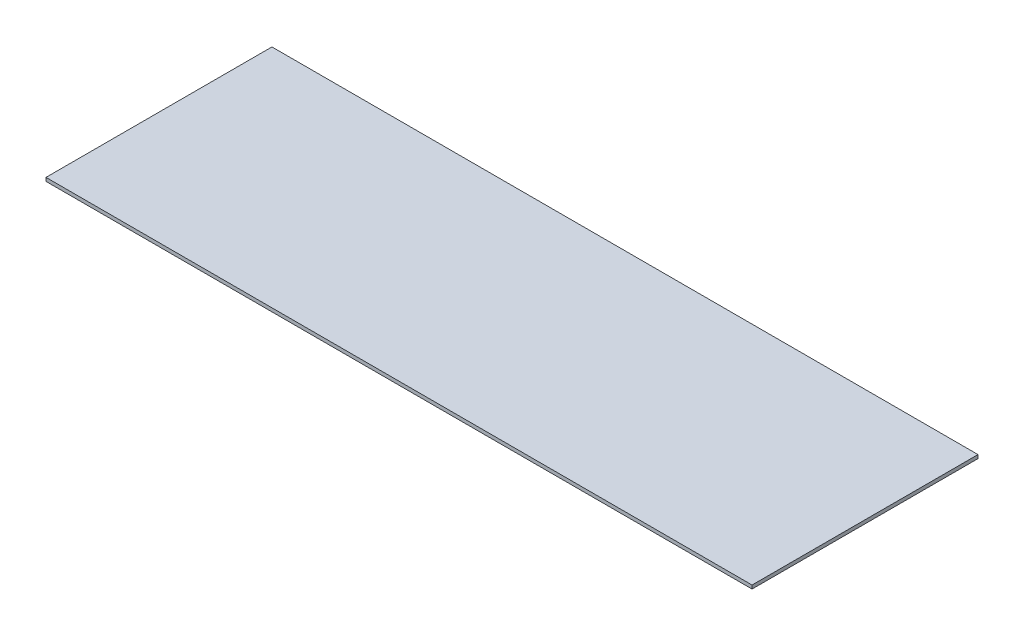
ISO-10303-21;
HEADER;
FILE_DESCRIPTION(('STEP AP214'),'2;1');
FILE_NAME('part.step','',(''),(''),'','','');
FILE_SCHEMA(('AUTOMOTIVE_DESIGN { 1 0 10303 214 1 1 1 1 }'));
ENDSEC;
DATA;
#1=APPLICATION_CONTEXT('core data for automotive mechanical design processes');
#2=APPLICATION_PROTOCOL_DEFINITION('international standard','automotive_design',2000,#1);
#3=PRODUCT_CONTEXT('',#1,'mechanical');
#4=PRODUCT('Part','Part','',(#3));
#5=PRODUCT_RELATED_PRODUCT_CATEGORY('part','',(#4));
#6=PRODUCT_DEFINITION_FORMATION('','',#4);
#7=PRODUCT_DEFINITION_CONTEXT('part definition',#1,'design');
#8=PRODUCT_DEFINITION('design','',#6,#7);
#9=PRODUCT_DEFINITION_SHAPE('','',#8);
#10=(LENGTH_UNIT() NAMED_UNIT(*) SI_UNIT(.MILLI.,.METRE.));
#11=(NAMED_UNIT(*) PLANE_ANGLE_UNIT() SI_UNIT($,.RADIAN.));
#12=(NAMED_UNIT(*) SI_UNIT($,.STERADIAN.) SOLID_ANGLE_UNIT());
#13=UNCERTAINTY_MEASURE_WITH_UNIT(LENGTH_MEASURE(1.E-05),#10,'distance_accuracy_value','');
#14=(GEOMETRIC_REPRESENTATION_CONTEXT(3) GLOBAL_UNCERTAINTY_ASSIGNED_CONTEXT((#13)) GLOBAL_UNIT_ASSIGNED_CONTEXT((#10,
#11,#12)) REPRESENTATION_CONTEXT('',''));
#15=CARTESIAN_POINT('',(0.,0.,0.));
#16=DIRECTION('',(0.,0.,1.));
#17=DIRECTION('',(1.,0.,0.));
#18=AXIS2_PLACEMENT_3D('',#15,#16,#17);
#19=CARTESIAN_POINT('',(317.5,1.5875,101.6));
#20=DIRECTION('',(-1.,0.,0.));
#21=DIRECTION('',(0.,0.,1.));
#22=AXIS2_PLACEMENT_3D('',#19,#20,#21);
#23=PLANE('',#22);
#24=DIRECTION('',(0.,0.,-1.));
#25=VECTOR('',#24,1.);
#26=CARTESIAN_POINT('',(317.5,-1.5875,101.6));
#27=LINE('',#26,#25);
#28=CARTESIAN_POINT('',(317.5,-1.5875,101.6));
#29=VERTEX_POINT('',#28);
#30=CARTESIAN_POINT('',(317.5,-1.5875,-101.6));
#31=VERTEX_POINT('',#30);
#32=EDGE_CURVE('E96',#29,#31,#27,.T.);
#33=ORIENTED_EDGE('',*,*,#32,.T.);
#34=DIRECTION('',(0.,-1.,0.));
#35=VECTOR('',#34,1.);
#36=CARTESIAN_POINT('',(317.5,1.5875,-101.6));
#37=LINE('',#36,#35);
#38=CARTESIAN_POINT('',(317.5,1.5875,-101.6));
#39=VERTEX_POINT('',#38);
#40=EDGE_CURVE('E11',#39,#31,#37,.T.);
#41=ORIENTED_EDGE('',*,*,#40,.F.);
#42=DIRECTION('',(0.,0.,-1.));
#43=VECTOR('',#42,1.);
#44=CARTESIAN_POINT('',(317.5,1.5875,101.6));
#45=LINE('',#44,#43);
#46=CARTESIAN_POINT('',(317.5,1.5875,101.6));
#47=VERTEX_POINT('',#46);
#48=EDGE_CURVE('E84',#47,#39,#45,.T.);
#49=ORIENTED_EDGE('',*,*,#48,.F.);
#50=DIRECTION('',(0.,-1.,0.));
#51=VECTOR('',#50,1.);
#52=CARTESIAN_POINT('',(317.5,1.5875,101.6));
#53=LINE('',#52,#51);
#54=EDGE_CURVE('E92',#47,#29,#53,.T.);
#55=ORIENTED_EDGE('',*,*,#54,.T.);
#56=EDGE_LOOP('',(#33,#41,#49,#55));
#57=FACE_BOUND('',#56,.T.);
#58=ADVANCED_FACE('F33',(#57),#23,.F.);
#59=CARTESIAN_POINT('',(-317.5,1.5875,-101.6));
#60=DIRECTION('',(0.,0.,1.));
#61=DIRECTION('',(1.,0.,0.));
#62=AXIS2_PLACEMENT_3D('',#59,#60,#61);
#63=PLANE('',#62);
#64=DIRECTION('',(-1.,0.,0.));
#65=VECTOR('',#64,1.);
#66=CARTESIAN_POINT('',(-317.5,-1.5875,-101.6));
#67=LINE('',#66,#65);
#68=CARTESIAN_POINT('',(-317.5,-1.5875,-101.6));
#69=VERTEX_POINT('',#68);
#70=EDGE_CURVE('E88',#31,#69,#67,.T.);
#71=ORIENTED_EDGE('',*,*,#70,.T.);
#72=DIRECTION('',(0.,-1.,0.));
#73=VECTOR('',#72,1.);
#74=CARTESIAN_POINT('',(-317.5,1.5875,-101.6));
#75=LINE('',#74,#73);
#76=CARTESIAN_POINT('',(-317.5,1.5875,-101.6));
#77=VERTEX_POINT('',#76);
#78=EDGE_CURVE('E41',#77,#69,#75,.T.);
#79=ORIENTED_EDGE('',*,*,#78,.F.);
#80=DIRECTION('',(-1.,0.,0.));
#81=VECTOR('',#80,1.);
#82=CARTESIAN_POINT('',(-317.5,1.5875,-101.6));
#83=LINE('',#82,#81);
#84=EDGE_CURVE('E79',#39,#77,#83,.T.);
#85=ORIENTED_EDGE('',*,*,#84,.F.);
#86=ORIENTED_EDGE('',*,*,#40,.T.);
#87=EDGE_LOOP('',(#71,#79,#85,#86));
#88=FACE_BOUND('',#87,.T.);
#89=ADVANCED_FACE('F87',(#88),#63,.F.);
#90=CARTESIAN_POINT('',(-317.5,1.5875,101.6));
#91=DIRECTION('',(1.,0.,0.));
#92=DIRECTION('',(0.,0.,-1.));
#93=AXIS2_PLACEMENT_3D('',#90,#91,#92);
#94=PLANE('',#93);
#95=DIRECTION('',(0.,0.,1.));
#96=VECTOR('',#95,1.);
#97=CARTESIAN_POINT('',(-317.5,-1.5875,101.6));
#98=LINE('',#97,#96);
#99=CARTESIAN_POINT('',(-317.5,-1.5875,101.6));
#100=VERTEX_POINT('',#99);
#101=EDGE_CURVE('E66',#69,#100,#98,.T.);
#102=ORIENTED_EDGE('',*,*,#101,.T.);
#103=DIRECTION('',(0.,-1.,0.));
#104=VECTOR('',#103,1.);
#105=CARTESIAN_POINT('',(-317.5,1.5875,101.6));
#106=LINE('',#105,#104);
#107=CARTESIAN_POINT('',(-317.5,1.5875,101.6));
#108=VERTEX_POINT('',#107);
#109=EDGE_CURVE('E89',#108,#100,#106,.T.);
#110=ORIENTED_EDGE('',*,*,#109,.F.);
#111=DIRECTION('',(0.,0.,1.));
#112=VECTOR('',#111,1.);
#113=CARTESIAN_POINT('',(-317.5,1.5875,101.6));
#114=LINE('',#113,#112);
#115=EDGE_CURVE('E82',#77,#108,#114,.T.);
#116=ORIENTED_EDGE('',*,*,#115,.F.);
#117=ORIENTED_EDGE('',*,*,#78,.T.);
#118=EDGE_LOOP('',(#102,#110,#116,#117));
#119=FACE_BOUND('',#118,.T.);
#120=ADVANCED_FACE('F90',(#119),#94,.F.);
#121=CARTESIAN_POINT('',(-317.5,1.5875,101.6));
#122=DIRECTION('',(0.,0.,-1.));
#123=DIRECTION('',(-1.,0.,0.));
#124=AXIS2_PLACEMENT_3D('',#121,#122,#123);
#125=PLANE('',#124);
#126=DIRECTION('',(1.,0.,0.));
#127=VECTOR('',#126,1.);
#128=CARTESIAN_POINT('',(-317.5,-1.5875,101.6));
#129=LINE('',#128,#127);
#130=EDGE_CURVE('E72',#100,#29,#129,.T.);
#131=ORIENTED_EDGE('',*,*,#130,.T.);
#132=ORIENTED_EDGE('',*,*,#54,.F.);
#133=DIRECTION('',(1.,0.,0.));
#134=VECTOR('',#133,1.);
#135=CARTESIAN_POINT('',(-317.5,1.5875,101.6));
#136=LINE('',#135,#134);
#137=EDGE_CURVE('E49',#108,#47,#136,.T.);
#138=ORIENTED_EDGE('',*,*,#137,.F.);
#139=ORIENTED_EDGE('',*,*,#109,.T.);
#140=EDGE_LOOP('',(#131,#132,#138,#139));
#141=FACE_BOUND('',#140,.T.);
#142=ADVANCED_FACE('F103',(#141),#125,.F.);
#143=CARTESIAN_POINT('',(0.,1.5875,0.));
#144=DIRECTION('',(0.,-1.,0.));
#145=DIRECTION('',(0.,0.,-1.));
#146=AXIS2_PLACEMENT_3D('',#143,#144,#145);
#147=PLANE('',#146);
#148=ORIENTED_EDGE('',*,*,#48,.T.);
#149=ORIENTED_EDGE('',*,*,#84,.T.);
#150=ORIENTED_EDGE('',*,*,#115,.T.);
#151=ORIENTED_EDGE('',*,*,#137,.T.);
#152=EDGE_LOOP('',(#148,#149,#150,#151));
#153=FACE_BOUND('',#152,.T.);
#154=ADVANCED_FACE('F80',(#153),#147,.F.);
#155=CARTESIAN_POINT('',(0.,-1.5875,0.));
#156=DIRECTION('',(0.,-1.,0.));
#157=DIRECTION('',(0.,0.,-1.));
#158=AXIS2_PLACEMENT_3D('',#155,#156,#157);
#159=PLANE('',#158);
#160=ORIENTED_EDGE('',*,*,#32,.F.);
#161=ORIENTED_EDGE('',*,*,#130,.F.);
#162=ORIENTED_EDGE('',*,*,#101,.F.);
#163=ORIENTED_EDGE('',*,*,#70,.F.);
#164=EDGE_LOOP('',(#160,#161,#162,#163));
#165=FACE_BOUND('',#164,.T.);
#166=ADVANCED_FACE('F106',(#165),#159,.T.);
#167=CLOSED_SHELL('',(#58,#89,#120,#142,#154,#166));
#168=MANIFOLD_SOLID_BREP('B2',#167);
#169=ADVANCED_BREP_SHAPE_REPRESENTATION('',(#18,#168),#14);
#170=SHAPE_DEFINITION_REPRESENTATION(#9,#169);
ENDSEC;
END-ISO-10303-21;
